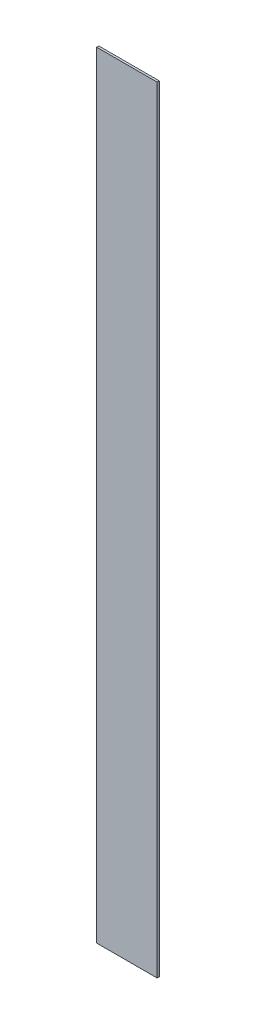
ISO-10303-21;
HEADER;
FILE_DESCRIPTION(('STEP AP214'),'2;1');
FILE_NAME('part.step','',(''),(''),'','','');
FILE_SCHEMA(('AUTOMOTIVE_DESIGN { 1 0 10303 214 1 1 1 1 }'));
ENDSEC;
DATA;
#1=APPLICATION_CONTEXT('core data for automotive mechanical design processes');
#2=APPLICATION_PROTOCOL_DEFINITION('international standard','automotive_design',2000,#1);
#3=PRODUCT_CONTEXT('',#1,'mechanical');
#4=PRODUCT('Part','Part','',(#3));
#5=PRODUCT_RELATED_PRODUCT_CATEGORY('part','',(#4));
#6=PRODUCT_DEFINITION_FORMATION('','',#4);
#7=PRODUCT_DEFINITION_CONTEXT('part definition',#1,'design');
#8=PRODUCT_DEFINITION('design','',#6,#7);
#9=PRODUCT_DEFINITION_SHAPE('','',#8);
#10=(LENGTH_UNIT() NAMED_UNIT(*) SI_UNIT(.MILLI.,.METRE.));
#11=(NAMED_UNIT(*) PLANE_ANGLE_UNIT() SI_UNIT($,.RADIAN.));
#12=(NAMED_UNIT(*) SI_UNIT($,.STERADIAN.) SOLID_ANGLE_UNIT());
#13=UNCERTAINTY_MEASURE_WITH_UNIT(LENGTH_MEASURE(1.E-05),#10,'distance_accuracy_value','');
#14=(GEOMETRIC_REPRESENTATION_CONTEXT(3) GLOBAL_UNCERTAINTY_ASSIGNED_CONTEXT((#13)) GLOBAL_UNIT_ASSIGNED_CONTEXT((#10,
#11,#12)) REPRESENTATION_CONTEXT('',''));
#15=CARTESIAN_POINT('',(0.,0.,0.));
#16=DIRECTION('',(0.,0.,1.));
#17=DIRECTION('',(1.,0.,0.));
#18=AXIS2_PLACEMENT_3D('',#15,#16,#17);
#19=CARTESIAN_POINT('',(70.,-900.,5.));
#20=DIRECTION('',(-1.,0.,0.));
#21=DIRECTION('',(0.,0.,1.));
#22=AXIS2_PLACEMENT_3D('',#19,#20,#21);
#23=PLANE('',#22);
#24=DIRECTION('',(0.,1.,0.));
#25=VECTOR('',#24,1.);
#26=CARTESIAN_POINT('',(70.,-900.,0.));
#27=LINE('',#26,#25);
#28=CARTESIAN_POINT('',(70.,-900.,0.));
#29=VERTEX_POINT('',#28);
#30=CARTESIAN_POINT('',(70.,900.,0.));
#31=VERTEX_POINT('',#30);
#32=EDGE_CURVE('E96',#29,#31,#27,.T.);
#33=ORIENTED_EDGE('',*,*,#32,.T.);
#34=DIRECTION('',(0.,0.,-1.));
#35=VECTOR('',#34,1.);
#36=CARTESIAN_POINT('',(70.,900.,5.));
#37=LINE('',#36,#35);
#38=CARTESIAN_POINT('',(70.,900.,5.));
#39=VERTEX_POINT('',#38);
#40=EDGE_CURVE('E11',#39,#31,#37,.T.);
#41=ORIENTED_EDGE('',*,*,#40,.F.);
#42=DIRECTION('',(0.,1.,0.));
#43=VECTOR('',#42,1.);
#44=CARTESIAN_POINT('',(70.,-900.,5.));
#45=LINE('',#44,#43);
#46=CARTESIAN_POINT('',(70.,-900.,5.));
#47=VERTEX_POINT('',#46);
#48=EDGE_CURVE('E84',#47,#39,#45,.T.);
#49=ORIENTED_EDGE('',*,*,#48,.F.);
#50=DIRECTION('',(0.,0.,-1.));
#51=VECTOR('',#50,1.);
#52=CARTESIAN_POINT('',(70.,-900.,5.));
#53=LINE('',#52,#51);
#54=EDGE_CURVE('E92',#47,#29,#53,.T.);
#55=ORIENTED_EDGE('',*,*,#54,.T.);
#56=EDGE_LOOP('',(#33,#41,#49,#55));
#57=FACE_BOUND('',#56,.T.);
#58=ADVANCED_FACE('F33',(#57),#23,.F.);
#59=CARTESIAN_POINT('',(-70.,900.,5.));
#60=DIRECTION('',(0.,-1.,0.));
#61=DIRECTION('',(0.,0.,-1.));
#62=AXIS2_PLACEMENT_3D('',#59,#60,#61);
#63=PLANE('',#62);
#64=DIRECTION('',(-1.,0.,0.));
#65=VECTOR('',#64,1.);
#66=CARTESIAN_POINT('',(-70.,900.,0.));
#67=LINE('',#66,#65);
#68=CARTESIAN_POINT('',(-70.,900.,0.));
#69=VERTEX_POINT('',#68);
#70=EDGE_CURVE('E88',#31,#69,#67,.T.);
#71=ORIENTED_EDGE('',*,*,#70,.T.);
#72=DIRECTION('',(0.,0.,-1.));
#73=VECTOR('',#72,1.);
#74=CARTESIAN_POINT('',(-70.,900.,5.));
#75=LINE('',#74,#73);
#76=CARTESIAN_POINT('',(-70.,900.,5.));
#77=VERTEX_POINT('',#76);
#78=EDGE_CURVE('E41',#77,#69,#75,.T.);
#79=ORIENTED_EDGE('',*,*,#78,.F.);
#80=DIRECTION('',(-1.,0.,0.));
#81=VECTOR('',#80,1.);
#82=CARTESIAN_POINT('',(-70.,900.,5.));
#83=LINE('',#82,#81);
#84=EDGE_CURVE('E79',#39,#77,#83,.T.);
#85=ORIENTED_EDGE('',*,*,#84,.F.);
#86=ORIENTED_EDGE('',*,*,#40,.T.);
#87=EDGE_LOOP('',(#71,#79,#85,#86));
#88=FACE_BOUND('',#87,.T.);
#89=ADVANCED_FACE('F87',(#88),#63,.F.);
#90=CARTESIAN_POINT('',(-70.,-900.,5.));
#91=DIRECTION('',(1.,0.,0.));
#92=DIRECTION('',(0.,0.,-1.));
#93=AXIS2_PLACEMENT_3D('',#90,#91,#92);
#94=PLANE('',#93);
#95=DIRECTION('',(0.,-1.,0.));
#96=VECTOR('',#95,1.);
#97=CARTESIAN_POINT('',(-70.,-900.,0.));
#98=LINE('',#97,#96);
#99=CARTESIAN_POINT('',(-70.,-900.,0.));
#100=VERTEX_POINT('',#99);
#101=EDGE_CURVE('E66',#69,#100,#98,.T.);
#102=ORIENTED_EDGE('',*,*,#101,.T.);
#103=DIRECTION('',(0.,0.,-1.));
#104=VECTOR('',#103,1.);
#105=CARTESIAN_POINT('',(-70.,-900.,5.));
#106=LINE('',#105,#104);
#107=CARTESIAN_POINT('',(-70.,-900.,5.));
#108=VERTEX_POINT('',#107);
#109=EDGE_CURVE('E89',#108,#100,#106,.T.);
#110=ORIENTED_EDGE('',*,*,#109,.F.);
#111=DIRECTION('',(0.,-1.,0.));
#112=VECTOR('',#111,1.);
#113=CARTESIAN_POINT('',(-70.,-900.,5.));
#114=LINE('',#113,#112);
#115=EDGE_CURVE('E82',#77,#108,#114,.T.);
#116=ORIENTED_EDGE('',*,*,#115,.F.);
#117=ORIENTED_EDGE('',*,*,#78,.T.);
#118=EDGE_LOOP('',(#102,#110,#116,#117));
#119=FACE_BOUND('',#118,.T.);
#120=ADVANCED_FACE('F90',(#119),#94,.F.);
#121=CARTESIAN_POINT('',(-70.,-900.,5.));
#122=DIRECTION('',(0.,1.,0.));
#123=DIRECTION('',(0.,0.,1.));
#124=AXIS2_PLACEMENT_3D('',#121,#122,#123);
#125=PLANE('',#124);
#126=DIRECTION('',(1.,0.,0.));
#127=VECTOR('',#126,1.);
#128=CARTESIAN_POINT('',(-70.,-900.,0.));
#129=LINE('',#128,#127);
#130=EDGE_CURVE('E72',#100,#29,#129,.T.);
#131=ORIENTED_EDGE('',*,*,#130,.T.);
#132=ORIENTED_EDGE('',*,*,#54,.F.);
#133=DIRECTION('',(1.,0.,0.));
#134=VECTOR('',#133,1.);
#135=CARTESIAN_POINT('',(-70.,-900.,5.));
#136=LINE('',#135,#134);
#137=EDGE_CURVE('E49',#108,#47,#136,.T.);
#138=ORIENTED_EDGE('',*,*,#137,.F.);
#139=ORIENTED_EDGE('',*,*,#109,.T.);
#140=EDGE_LOOP('',(#131,#132,#138,#139));
#141=FACE_BOUND('',#140,.T.);
#142=ADVANCED_FACE('F103',(#141),#125,.F.);
#143=CARTESIAN_POINT('',(0.,0.,5.));
#144=DIRECTION('',(0.,0.,-1.));
#145=DIRECTION('',(-1.,0.,0.));
#146=AXIS2_PLACEMENT_3D('',#143,#144,#145);
#147=PLANE('',#146);
#148=ORIENTED_EDGE('',*,*,#48,.T.);
#149=ORIENTED_EDGE('',*,*,#84,.T.);
#150=ORIENTED_EDGE('',*,*,#115,.T.);
#151=ORIENTED_EDGE('',*,*,#137,.T.);
#152=EDGE_LOOP('',(#148,#149,#150,#151));
#153=FACE_BOUND('',#152,.T.);
#154=ADVANCED_FACE('F80',(#153),#147,.F.);
#155=CARTESIAN_POINT('',(0.,0.,0.));
#156=DIRECTION('',(0.,0.,-1.));
#157=DIRECTION('',(-1.,0.,0.));
#158=AXIS2_PLACEMENT_3D('',#155,#156,#157);
#159=PLANE('',#158);
#160=ORIENTED_EDGE('',*,*,#32,.F.);
#161=ORIENTED_EDGE('',*,*,#130,.F.);
#162=ORIENTED_EDGE('',*,*,#101,.F.);
#163=ORIENTED_EDGE('',*,*,#70,.F.);
#164=EDGE_LOOP('',(#160,#161,#162,#163));
#165=FACE_BOUND('',#164,.T.);
#166=ADVANCED_FACE('F106',(#165),#159,.T.);
#167=CLOSED_SHELL('',(#58,#89,#120,#142,#154,#166));
#168=MANIFOLD_SOLID_BREP('B2',#167);
#169=ADVANCED_BREP_SHAPE_REPRESENTATION('',(#18,#168),#14);
#170=SHAPE_DEFINITION_REPRESENTATION(#9,#169);
ENDSEC;
END-ISO-10303-21;
